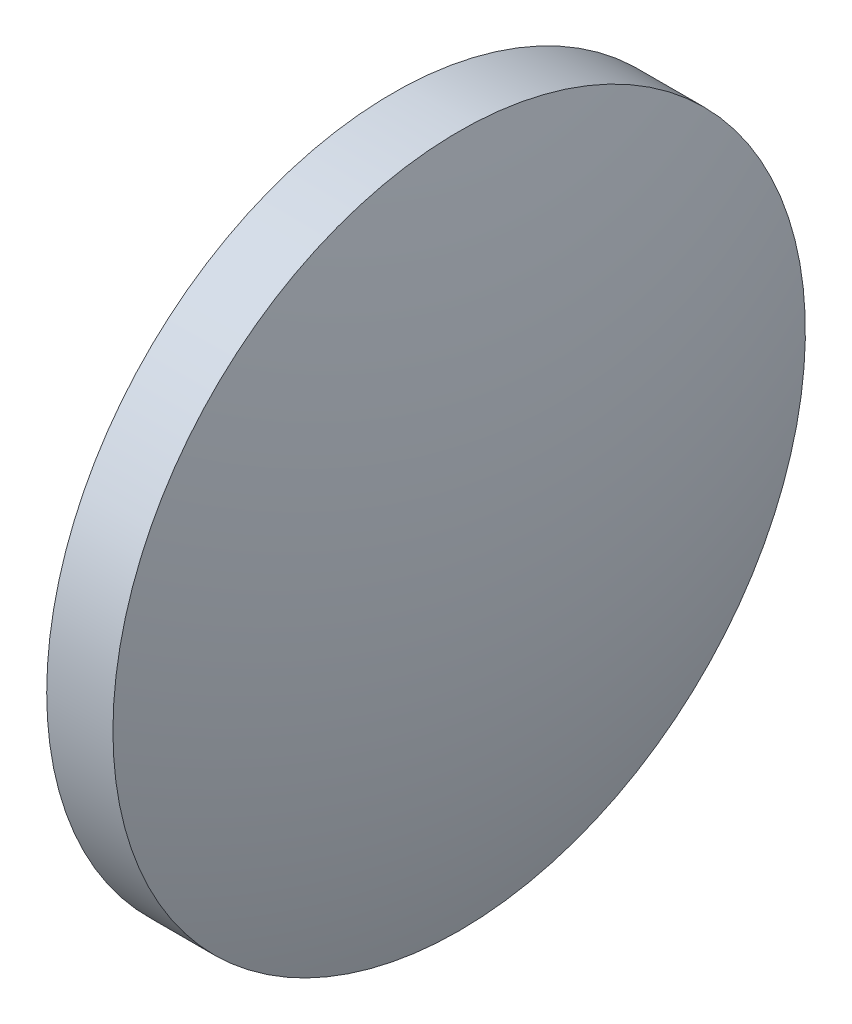
ISO-10303-21;
HEADER;
FILE_DESCRIPTION(('STEP AP214'),'2;1');
FILE_NAME('part.step','',(''),(''),'','','');
FILE_SCHEMA(('AUTOMOTIVE_DESIGN { 1 0 10303 214 1 1 1 1 }'));
ENDSEC;
DATA;
#1=APPLICATION_CONTEXT('core data for automotive mechanical design processes');
#2=APPLICATION_PROTOCOL_DEFINITION('international standard','automotive_design',2000,#1);
#3=PRODUCT_CONTEXT('',#1,'mechanical');
#4=PRODUCT('Part','Part','',(#3));
#5=PRODUCT_RELATED_PRODUCT_CATEGORY('part','',(#4));
#6=PRODUCT_DEFINITION_FORMATION('','',#4);
#7=PRODUCT_DEFINITION_CONTEXT('part definition',#1,'design');
#8=PRODUCT_DEFINITION('design','',#6,#7);
#9=PRODUCT_DEFINITION_SHAPE('','',#8);
#10=(LENGTH_UNIT() NAMED_UNIT(*) SI_UNIT(.MILLI.,.METRE.));
#11=(NAMED_UNIT(*) PLANE_ANGLE_UNIT() SI_UNIT($,.RADIAN.));
#12=(NAMED_UNIT(*) SI_UNIT($,.STERADIAN.) SOLID_ANGLE_UNIT());
#13=UNCERTAINTY_MEASURE_WITH_UNIT(LENGTH_MEASURE(1.E-05),#10,'distance_accuracy_value','');
#14=(GEOMETRIC_REPRESENTATION_CONTEXT(3) GLOBAL_UNCERTAINTY_ASSIGNED_CONTEXT((#13)) GLOBAL_UNIT_ASSIGNED_CONTEXT((#10,
#11,#12)) REPRESENTATION_CONTEXT('',''));
#15=CARTESIAN_POINT('',(0.,0.,0.));
#16=DIRECTION('',(0.,0.,1.));
#17=DIRECTION('',(1.,0.,0.));
#18=AXIS2_PLACEMENT_3D('',#15,#16,#17);
#19=CARTESIAN_POINT('',(479.446246890408,80.1994568520156,0.));
#20=DIRECTION('',(-1.,0.,0.));
#21=DIRECTION('',(0.,-1.,0.));
#22=AXIS2_PLACEMENT_3D('',#19,#20,#21);
#23=SPHERICAL_SURFACE('',#22,25.8318503937008);
#24=CARTESIAN_POINT('',(504.008097284109,80.1994568520156,0.));
#25=DIRECTION('',(-1.,0.,0.));
#26=DIRECTION('',(0.,0.,1.));
#27=AXIS2_PLACEMENT_3D('',#24,#25,#26);
#28=CIRCLE('',#27,8.00000000000001);
#29=CARTESIAN_POINT('',(504.008097284109,80.1994568520156,8.00000000000001));
#30=VERTEX_POINT('',#29);
#31=EDGE_CURVE('E10',#30,#30,#28,.T.);
#32=ORIENTED_EDGE('',*,*,#31,.F.);
#33=EDGE_LOOP('',(#32));
#34=FACE_BOUND('',#33,.T.);
#35=ADVANCED_FACE('F35',(#34),#23,.T.);
#36=CARTESIAN_POINT('',(500.830124811117,80.1994568520156,0.));
#37=DIRECTION('',(-1.,0.,0.));
#38=DIRECTION('',(0.,0.,1.));
#39=AXIS2_PLACEMENT_3D('',#36,#37,#38);
#40=CYLINDRICAL_SURFACE('',#39,8.00000000000001);
#41=CARTESIAN_POINT('',(502.478097284109,80.1994568520156,0.));
#42=DIRECTION('',(-1.,0.,0.));
#43=DIRECTION('',(0.,0.,1.));
#44=AXIS2_PLACEMENT_3D('',#41,#42,#43);
#45=CIRCLE('',#44,8.00000000000001);
#46=CARTESIAN_POINT('',(502.478097284109,80.1994568520156,8.00000000000001));
#47=VERTEX_POINT('',#46);
#48=EDGE_CURVE('E41',#47,#47,#45,.T.);
#49=ORIENTED_EDGE('',*,*,#48,.F.);
#50=EDGE_LOOP('',(#49));
#51=FACE_BOUND('',#50,.T.);
#52=ORIENTED_EDGE('',*,*,#31,.T.);
#53=EDGE_LOOP('',(#52));
#54=FACE_BOUND('',#53,.T.);
#55=ADVANCED_FACE('F49',(#51,#54),#40,.T.);
#56=CARTESIAN_POINT('',(502.478097284109,80.1994568520156,0.));
#57=DIRECTION('',(1.,0.,0.));
#58=DIRECTION('',(0.,0.,-1.));
#59=AXIS2_PLACEMENT_3D('',#56,#57,#58);
#60=PLANE('',#59);
#61=ORIENTED_EDGE('',*,*,#48,.T.);
#62=EDGE_LOOP('',(#61));
#63=FACE_BOUND('',#62,.T.);
#64=ADVANCED_FACE('F47',(#63),#60,.F.);
#65=CLOSED_SHELL('',(#35,#55,#64));
#66=MANIFOLD_SOLID_BREP('B2',#65);
#67=ADVANCED_BREP_SHAPE_REPRESENTATION('',(#18,#66),#14);
#68=SHAPE_DEFINITION_REPRESENTATION(#9,#67);
ENDSEC;
END-ISO-10303-21;
